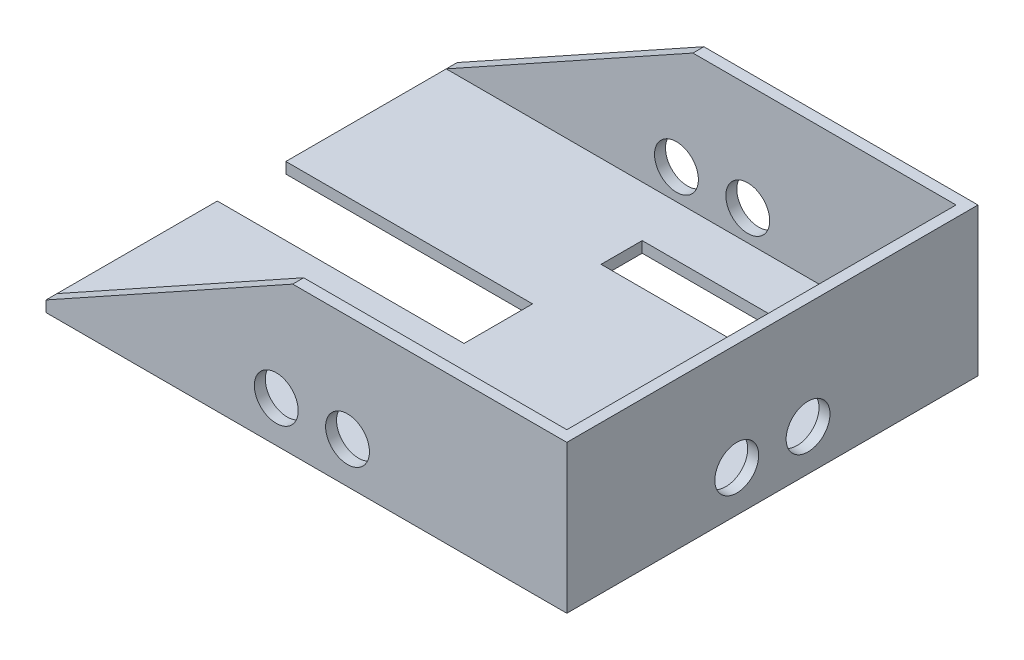
ISO-10303-21;
HEADER;
FILE_DESCRIPTION(('STEP AP214'),'2;1');
FILE_NAME('part.step','',(''),(''),'','','');
FILE_SCHEMA(('AUTOMOTIVE_DESIGN { 1 0 10303 214 1 1 1 1 }'));
ENDSEC;
DATA;
#1=APPLICATION_CONTEXT('core data for automotive mechanical design processes');
#2=APPLICATION_PROTOCOL_DEFINITION('international standard','automotive_design',2000,#1);
#3=PRODUCT_CONTEXT('',#1,'mechanical');
#4=PRODUCT('Part','Part','',(#3));
#5=PRODUCT_RELATED_PRODUCT_CATEGORY('part','',(#4));
#6=PRODUCT_DEFINITION_FORMATION('','',#4);
#7=PRODUCT_DEFINITION_CONTEXT('part definition',#1,'design');
#8=PRODUCT_DEFINITION('design','',#6,#7);
#9=PRODUCT_DEFINITION_SHAPE('','',#8);
#10=(LENGTH_UNIT() NAMED_UNIT(*) SI_UNIT(.MILLI.,.METRE.));
#11=(NAMED_UNIT(*) PLANE_ANGLE_UNIT() SI_UNIT($,.RADIAN.));
#12=(NAMED_UNIT(*) SI_UNIT($,.STERADIAN.) SOLID_ANGLE_UNIT());
#13=UNCERTAINTY_MEASURE_WITH_UNIT(LENGTH_MEASURE(1.E-05),#10,'distance_accuracy_value','');
#14=(GEOMETRIC_REPRESENTATION_CONTEXT(3) GLOBAL_UNCERTAINTY_ASSIGNED_CONTEXT((#13)) GLOBAL_UNIT_ASSIGNED_CONTEXT((#10,
#11,#12)) REPRESENTATION_CONTEXT('',''));
#15=CARTESIAN_POINT('',(0.,0.,0.));
#16=DIRECTION('',(0.,0.,1.));
#17=DIRECTION('',(1.,0.,0.));
#18=AXIS2_PLACEMENT_3D('',#15,#16,#17);
#19=CARTESIAN_POINT('',(0.,4.,0.));
#20=DIRECTION('',(0.,1.,0.));
#21=DIRECTION('',(0.,0.,1.));
#22=AXIS2_PLACEMENT_3D('',#19,#20,#21);
#23=PLANE('',#22);
#24=DIRECTION('',(0.,0.,1.));
#25=VECTOR('',#24,1.);
#26=CARTESIAN_POINT('',(75.,4.,-52.5));
#27=LINE('',#26,#25);
#28=CARTESIAN_POINT('',(75.,4.,-52.5));
#29=VERTEX_POINT('',#28);
#30=CARTESIAN_POINT('',(75.,4.,-37.5));
#31=VERTEX_POINT('',#30);
#32=EDGE_CURVE('E187',#29,#31,#27,.T.);
#33=ORIENTED_EDGE('',*,*,#32,.T.);
#34=DIRECTION('',(-1.,0.,0.));
#35=VECTOR('',#34,1.);
#36=CARTESIAN_POINT('',(75.,4.,-37.5));
#37=LINE('',#36,#35);
#38=CARTESIAN_POINT('',(-4.99999999999999,4.,-37.5));
#39=VERTEX_POINT('',#38);
#40=EDGE_CURVE('E198',#31,#39,#37,.T.);
#41=ORIENTED_EDGE('',*,*,#40,.T.);
#42=DIRECTION('',(0.,0.,1.));
#43=VECTOR('',#42,1.);
#44=CARTESIAN_POINT('',(-4.99999999999999,4.,-52.5));
#45=LINE('',#44,#43);
#46=CARTESIAN_POINT('',(-4.99999999999999,4.,-52.5));
#47=VERTEX_POINT('',#46);
#48=EDGE_CURVE('E196',#47,#39,#45,.T.);
#49=ORIENTED_EDGE('',*,*,#48,.F.);
#50=DIRECTION('',(-1.,0.,0.));
#51=VECTOR('',#50,1.);
#52=CARTESIAN_POINT('',(75.,4.,-52.5));
#53=LINE('',#52,#51);
#54=EDGE_CURVE('E179',#29,#47,#53,.T.);
#55=ORIENTED_EDGE('',*,*,#54,.F.);
#56=EDGE_LOOP('',(#33,#41,#49,#55));
#57=FACE_BOUND('',#56,.T.);
#58=DIRECTION('',(0.,0.,-1.));
#59=VECTOR('',#58,1.);
#60=CARTESIAN_POINT('',(91.,4.,-71.));
#61=LINE('',#60,#59);
#62=CARTESIAN_POINT('',(91.,4.,71.));
#63=VERTEX_POINT('',#62);
#64=CARTESIAN_POINT('',(91.,4.,-71.));
#65=VERTEX_POINT('',#64);
#66=EDGE_CURVE('E246',#63,#65,#61,.T.);
#67=ORIENTED_EDGE('',*,*,#66,.T.);
#68=DIRECTION('',(1.,0.,0.));
#69=VECTOR('',#68,1.);
#70=CARTESIAN_POINT('',(-95.,4.,-71.));
#71=LINE('',#70,#69);
#72=CARTESIAN_POINT('',(-95.,4.,-71.));
#73=VERTEX_POINT('',#72);
#74=EDGE_CURVE('E254',#73,#65,#71,.T.);
#75=ORIENTED_EDGE('',*,*,#74,.F.);
#76=DIRECTION('',(0.,0.,1.));
#77=VECTOR('',#76,1.);
#78=CARTESIAN_POINT('',(-95.,4.,-12.5));
#79=LINE('',#78,#77);
#80=CARTESIAN_POINT('',(-95.,4.,-12.5));
#81=VERTEX_POINT('',#80);
#82=EDGE_CURVE('E295',#73,#81,#79,.T.);
#83=ORIENTED_EDGE('',*,*,#82,.T.);
#84=DIRECTION('',(1.,0.,0.));
#85=VECTOR('',#84,1.);
#86=CARTESIAN_POINT('',(-4.99999999999997,4.,-12.5));
#87=LINE('',#86,#85);
#88=CARTESIAN_POINT('',(-4.99999999999997,4.,-12.5));
#89=VERTEX_POINT('',#88);
#90=EDGE_CURVE('E294',#81,#89,#87,.T.);
#91=ORIENTED_EDGE('',*,*,#90,.T.);
#92=DIRECTION('',(0.,0.,1.));
#93=VECTOR('',#92,1.);
#94=CARTESIAN_POINT('',(-4.99999999999996,4.,12.5));
#95=LINE('',#94,#93);
#96=CARTESIAN_POINT('',(-4.99999999999996,4.,12.5));
#97=VERTEX_POINT('',#96);
#98=EDGE_CURVE('E297',#89,#97,#95,.T.);
#99=ORIENTED_EDGE('',*,*,#98,.T.);
#100=DIRECTION('',(-1.,0.,0.));
#101=VECTOR('',#100,1.);
#102=CARTESIAN_POINT('',(-4.99999999999996,4.,12.5));
#103=LINE('',#102,#101);
#104=CARTESIAN_POINT('',(-95.,4.,12.5));
#105=VERTEX_POINT('',#104);
#106=EDGE_CURVE('E299',#97,#105,#103,.T.);
#107=ORIENTED_EDGE('',*,*,#106,.T.);
#108=DIRECTION('',(0.,0.,1.));
#109=VECTOR('',#108,1.);
#110=CARTESIAN_POINT('',(-95.,4.,75.));
#111=LINE('',#110,#109);
#112=CARTESIAN_POINT('',(-95.,4.,71.));
#113=VERTEX_POINT('',#112);
#114=EDGE_CURVE('E301',#105,#113,#111,.T.);
#115=ORIENTED_EDGE('',*,*,#114,.T.);
#116=DIRECTION('',(1.,0.,0.));
#117=VECTOR('',#116,1.);
#118=CARTESIAN_POINT('',(-95.,4.,71.));
#119=LINE('',#118,#117);
#120=EDGE_CURVE('E270',#113,#63,#119,.T.);
#121=ORIENTED_EDGE('',*,*,#120,.T.);
#122=EDGE_LOOP('',(#67,#75,#83,#91,#99,#107,#115,#121));
#123=FACE_BOUND('',#122,.T.);
#124=DIRECTION('',(-1.,0.,0.));
#125=VECTOR('',#124,1.);
#126=CARTESIAN_POINT('',(75.,4.,37.5));
#127=LINE('',#126,#125);
#128=CARTESIAN_POINT('',(75.,4.,37.5));
#129=VERTEX_POINT('',#128);
#130=CARTESIAN_POINT('',(-4.99999999999999,4.,37.5));
#131=VERTEX_POINT('',#130);
#132=EDGE_CURVE('E215',#129,#131,#127,.T.);
#133=ORIENTED_EDGE('',*,*,#132,.F.);
#134=DIRECTION('',(0.,0.,-1.));
#135=VECTOR('',#134,1.);
#136=CARTESIAN_POINT('',(75.,4.,52.5));
#137=LINE('',#136,#135);
#138=CARTESIAN_POINT('',(75.,4.,52.5));
#139=VERTEX_POINT('',#138);
#140=EDGE_CURVE('E213',#139,#129,#137,.T.);
#141=ORIENTED_EDGE('',*,*,#140,.F.);
#142=DIRECTION('',(-1.,0.,0.));
#143=VECTOR('',#142,1.);
#144=CARTESIAN_POINT('',(75.,4.,52.5));
#145=LINE('',#144,#143);
#146=CARTESIAN_POINT('',(-4.99999999999999,4.,52.5));
#147=VERTEX_POINT('',#146);
#148=EDGE_CURVE('E221',#139,#147,#145,.T.);
#149=ORIENTED_EDGE('',*,*,#148,.T.);
#150=DIRECTION('',(0.,0.,-1.));
#151=VECTOR('',#150,1.);
#152=CARTESIAN_POINT('',(-4.99999999999999,4.,52.5));
#153=LINE('',#152,#151);
#154=EDGE_CURVE('E218',#147,#131,#153,.T.);
#155=ORIENTED_EDGE('',*,*,#154,.T.);
#156=EDGE_LOOP('',(#133,#141,#149,#155));
#157=FACE_BOUND('',#156,.T.);
#158=ADVANCED_FACE('F32',(#57,#123,#157),#23,.T.);
#159=CARTESIAN_POINT('',(0.,0.,0.));
#160=DIRECTION('',(0.,1.,0.));
#161=DIRECTION('',(0.,0.,1.));
#162=AXIS2_PLACEMENT_3D('',#159,#160,#161);
#163=PLANE('',#162);
#164=DIRECTION('',(-1.,0.,0.));
#165=VECTOR('',#164,1.);
#166=CARTESIAN_POINT('',(75.,0.,-37.5));
#167=LINE('',#166,#165);
#168=CARTESIAN_POINT('',(75.,0.,-37.5));
#169=VERTEX_POINT('',#168);
#170=CARTESIAN_POINT('',(-4.99999999999999,0.,-37.5));
#171=VERTEX_POINT('',#170);
#172=EDGE_CURVE('E192',#169,#171,#167,.T.);
#173=ORIENTED_EDGE('',*,*,#172,.F.);
#174=DIRECTION('',(0.,0.,1.));
#175=VECTOR('',#174,1.);
#176=CARTESIAN_POINT('',(75.,0.,-52.5));
#177=LINE('',#176,#175);
#178=CARTESIAN_POINT('',(75.,0.,-52.5));
#179=VERTEX_POINT('',#178);
#180=EDGE_CURVE('E55',#179,#169,#177,.T.);
#181=ORIENTED_EDGE('',*,*,#180,.F.);
#182=DIRECTION('',(-1.,0.,0.));
#183=VECTOR('',#182,1.);
#184=CARTESIAN_POINT('',(75.,0.,-52.5));
#185=LINE('',#184,#183);
#186=CARTESIAN_POINT('',(-4.99999999999999,0.,-52.5));
#187=VERTEX_POINT('',#186);
#188=EDGE_CURVE('E182',#179,#187,#185,.T.);
#189=ORIENTED_EDGE('',*,*,#188,.T.);
#190=DIRECTION('',(0.,0.,1.));
#191=VECTOR('',#190,1.);
#192=CARTESIAN_POINT('',(-4.99999999999999,0.,-52.5));
#193=LINE('',#192,#191);
#194=EDGE_CURVE('E206',#187,#171,#193,.T.);
#195=ORIENTED_EDGE('',*,*,#194,.T.);
#196=EDGE_LOOP('',(#173,#181,#189,#195));
#197=FACE_BOUND('',#196,.T.);
#198=DIRECTION('',(0.,0.,1.));
#199=VECTOR('',#198,1.);
#200=CARTESIAN_POINT('',(-95.,0.,-12.5));
#201=LINE('',#200,#199);
#202=CARTESIAN_POINT('',(-95.,0.,-75.));
#203=VERTEX_POINT('',#202);
#204=CARTESIAN_POINT('',(-95.,0.,-12.5));
#205=VERTEX_POINT('',#204);
#206=EDGE_CURVE('E286',#203,#205,#201,.T.);
#207=ORIENTED_EDGE('',*,*,#206,.F.);
#208=DIRECTION('',(-1.,0.,0.));
#209=VECTOR('',#208,1.);
#210=CARTESIAN_POINT('',(95.,0.,-75.));
#211=LINE('',#210,#209);
#212=CARTESIAN_POINT('',(95.,0.,-75.));
#213=VERTEX_POINT('',#212);
#214=EDGE_CURVE('E319',#213,#203,#211,.T.);
#215=ORIENTED_EDGE('',*,*,#214,.F.);
#216=DIRECTION('',(0.,0.,-1.));
#217=VECTOR('',#216,1.);
#218=CARTESIAN_POINT('',(95.,0.,75.));
#219=LINE('',#218,#217);
#220=CARTESIAN_POINT('',(95.,0.,75.));
#221=VERTEX_POINT('',#220);
#222=EDGE_CURVE('E317',#221,#213,#219,.T.);
#223=ORIENTED_EDGE('',*,*,#222,.F.);
#224=DIRECTION('',(1.,0.,0.));
#225=VECTOR('',#224,1.);
#226=CARTESIAN_POINT('',(95.,0.,75.));
#227=LINE('',#226,#225);
#228=CARTESIAN_POINT('',(-95.,0.,75.));
#229=VERTEX_POINT('',#228);
#230=EDGE_CURVE('E315',#229,#221,#227,.T.);
#231=ORIENTED_EDGE('',*,*,#230,.F.);
#232=DIRECTION('',(0.,0.,1.));
#233=VECTOR('',#232,1.);
#234=CARTESIAN_POINT('',(-95.,0.,75.));
#235=LINE('',#234,#233);
#236=CARTESIAN_POINT('',(-95.,0.,12.5));
#237=VERTEX_POINT('',#236);
#238=EDGE_CURVE('E313',#237,#229,#235,.T.);
#239=ORIENTED_EDGE('',*,*,#238,.F.);
#240=DIRECTION('',(-1.,0.,0.));
#241=VECTOR('',#240,1.);
#242=CARTESIAN_POINT('',(-4.99999999999996,0.,12.5));
#243=LINE('',#242,#241);
#244=CARTESIAN_POINT('',(-4.99999999999996,0.,12.5));
#245=VERTEX_POINT('',#244);
#246=EDGE_CURVE('E311',#245,#237,#243,.T.);
#247=ORIENTED_EDGE('',*,*,#246,.F.);
#248=DIRECTION('',(0.,0.,1.));
#249=VECTOR('',#248,1.);
#250=CARTESIAN_POINT('',(-4.99999999999996,0.,12.5));
#251=LINE('',#250,#249);
#252=CARTESIAN_POINT('',(-4.99999999999997,0.,-12.5));
#253=VERTEX_POINT('',#252);
#254=EDGE_CURVE('E309',#253,#245,#251,.T.);
#255=ORIENTED_EDGE('',*,*,#254,.F.);
#256=DIRECTION('',(1.,0.,0.));
#257=VECTOR('',#256,1.);
#258=CARTESIAN_POINT('',(-4.99999999999997,0.,-12.5));
#259=LINE('',#258,#257);
#260=EDGE_CURVE('E307',#205,#253,#259,.T.);
#261=ORIENTED_EDGE('',*,*,#260,.F.);
#262=EDGE_LOOP('',(#207,#215,#223,#231,#239,#247,#255,#261));
#263=FACE_BOUND('',#262,.T.);
#264=DIRECTION('',(0.,0.,-1.));
#265=VECTOR('',#264,1.);
#266=CARTESIAN_POINT('',(75.,0.,52.5));
#267=LINE('',#266,#265);
#268=CARTESIAN_POINT('',(75.,0.,52.5));
#269=VERTEX_POINT('',#268);
#270=CARTESIAN_POINT('',(75.,0.,37.5));
#271=VERTEX_POINT('',#270);
#272=EDGE_CURVE('E183',#269,#271,#267,.T.);
#273=ORIENTED_EDGE('',*,*,#272,.T.);
#274=DIRECTION('',(-1.,0.,0.));
#275=VECTOR('',#274,1.);
#276=CARTESIAN_POINT('',(75.,0.,37.5));
#277=LINE('',#276,#275);
#278=CARTESIAN_POINT('',(-4.99999999999999,0.,37.5));
#279=VERTEX_POINT('',#278);
#280=EDGE_CURVE('E227',#271,#279,#277,.T.);
#281=ORIENTED_EDGE('',*,*,#280,.T.);
#282=DIRECTION('',(0.,0.,-1.));
#283=VECTOR('',#282,1.);
#284=CARTESIAN_POINT('',(-4.99999999999999,0.,52.5));
#285=LINE('',#284,#283);
#286=CARTESIAN_POINT('',(-4.99999999999999,0.,52.5));
#287=VERTEX_POINT('',#286);
#288=EDGE_CURVE('E230',#287,#279,#285,.T.);
#289=ORIENTED_EDGE('',*,*,#288,.F.);
#290=DIRECTION('',(-1.,0.,0.));
#291=VECTOR('',#290,1.);
#292=CARTESIAN_POINT('',(75.,0.,52.5));
#293=LINE('',#292,#291);
#294=EDGE_CURVE('E216',#269,#287,#293,.T.);
#295=ORIENTED_EDGE('',*,*,#294,.F.);
#296=EDGE_LOOP('',(#273,#281,#289,#295));
#297=FACE_BOUND('',#296,.T.);
#298=ADVANCED_FACE('F349',(#197,#263,#297),#163,.F.);
#299=CARTESIAN_POINT('',(-95.,4.,-12.5));
#300=DIRECTION('',(1.,0.,0.));
#301=DIRECTION('',(0.,0.,-1.));
#302=AXIS2_PLACEMENT_3D('',#299,#300,#301);
#303=PLANE('',#302);
#304=ORIENTED_EDGE('',*,*,#206,.T.);
#305=DIRECTION('',(0.,-1.,0.));
#306=VECTOR('',#305,1.);
#307=CARTESIAN_POINT('',(-95.,4.,-12.5));
#308=LINE('',#307,#306);
#309=EDGE_CURVE('E11',#81,#205,#308,.T.);
#310=ORIENTED_EDGE('',*,*,#309,.F.);
#311=ORIENTED_EDGE('',*,*,#82,.F.);
#312=CARTESIAN_POINT('',(-95.,4.,-75.));
#313=VERTEX_POINT('',#312);
#314=EDGE_CURVE('E291',#313,#73,#79,.T.);
#315=ORIENTED_EDGE('',*,*,#314,.F.);
#316=DIRECTION('',(0.,-1.,0.));
#317=VECTOR('',#316,1.);
#318=CARTESIAN_POINT('',(-95.,4.,-75.));
#319=LINE('',#318,#317);
#320=EDGE_CURVE('E304',#313,#203,#319,.T.);
#321=ORIENTED_EDGE('',*,*,#320,.T.);
#322=EDGE_LOOP('',(#304,#310,#311,#315,#321));
#323=FACE_BOUND('',#322,.T.);
#324=ADVANCED_FACE('F34',(#323),#303,.F.);
#325=CARTESIAN_POINT('',(-4.99999999999997,4.,-12.5));
#326=DIRECTION('',(0.,0.,-1.));
#327=DIRECTION('',(-1.,0.,0.));
#328=AXIS2_PLACEMENT_3D('',#325,#326,#327);
#329=PLANE('',#328);
#330=ORIENTED_EDGE('',*,*,#260,.T.);
#331=DIRECTION('',(0.,-1.,0.));
#332=VECTOR('',#331,1.);
#333=CARTESIAN_POINT('',(-4.99999999999997,4.,-12.5));
#334=LINE('',#333,#332);
#335=EDGE_CURVE('E40',#89,#253,#334,.T.);
#336=ORIENTED_EDGE('',*,*,#335,.F.);
#337=ORIENTED_EDGE('',*,*,#90,.F.);
#338=ORIENTED_EDGE('',*,*,#309,.T.);
#339=EDGE_LOOP('',(#330,#336,#337,#338));
#340=FACE_BOUND('',#339,.T.);
#341=ADVANCED_FACE('F366',(#340),#329,.F.);
#342=CARTESIAN_POINT('',(-4.99999999999996,4.,12.5));
#343=DIRECTION('',(1.,0.,0.));
#344=DIRECTION('',(0.,0.,-1.));
#345=AXIS2_PLACEMENT_3D('',#342,#343,#344);
#346=PLANE('',#345);
#347=ORIENTED_EDGE('',*,*,#254,.T.);
#348=DIRECTION('',(0.,-1.,0.));
#349=VECTOR('',#348,1.);
#350=CARTESIAN_POINT('',(-4.99999999999996,4.,12.5));
#351=LINE('',#350,#349);
#352=EDGE_CURVE('E335',#97,#245,#351,.T.);
#353=ORIENTED_EDGE('',*,*,#352,.F.);
#354=ORIENTED_EDGE('',*,*,#98,.F.);
#355=ORIENTED_EDGE('',*,*,#335,.T.);
#356=EDGE_LOOP('',(#347,#353,#354,#355));
#357=FACE_BOUND('',#356,.T.);
#358=ADVANCED_FACE('F342',(#357),#346,.F.);
#359=CARTESIAN_POINT('',(-4.99999999999996,4.,12.5));
#360=DIRECTION('',(0.,0.,1.));
#361=DIRECTION('',(1.,0.,0.));
#362=AXIS2_PLACEMENT_3D('',#359,#360,#361);
#363=PLANE('',#362);
#364=ORIENTED_EDGE('',*,*,#246,.T.);
#365=DIRECTION('',(0.,-1.,0.));
#366=VECTOR('',#365,1.);
#367=CARTESIAN_POINT('',(-95.,4.,12.5));
#368=LINE('',#367,#366);
#369=EDGE_CURVE('E332',#105,#237,#368,.T.);
#370=ORIENTED_EDGE('',*,*,#369,.F.);
#371=ORIENTED_EDGE('',*,*,#106,.F.);
#372=ORIENTED_EDGE('',*,*,#352,.T.);
#373=EDGE_LOOP('',(#364,#370,#371,#372));
#374=FACE_BOUND('',#373,.T.);
#375=ADVANCED_FACE('F355',(#374),#363,.F.);
#376=CARTESIAN_POINT('',(-95.,4.,75.));
#377=DIRECTION('',(1.,0.,0.));
#378=DIRECTION('',(0.,0.,-1.));
#379=AXIS2_PLACEMENT_3D('',#376,#377,#378);
#380=PLANE('',#379);
#381=ORIENTED_EDGE('',*,*,#238,.T.);
#382=DIRECTION('',(0.,-1.,0.));
#383=VECTOR('',#382,1.);
#384=CARTESIAN_POINT('',(-95.,4.,75.));
#385=LINE('',#384,#383);
#386=CARTESIAN_POINT('',(-95.,4.,75.));
#387=VERTEX_POINT('',#386);
#388=EDGE_CURVE('E329',#387,#229,#385,.T.);
#389=ORIENTED_EDGE('',*,*,#388,.F.);
#390=DIRECTION('',(0.,0.,1.));
#391=VECTOR('',#390,1.);
#392=CARTESIAN_POINT('',(-95.,4.,71.));
#393=LINE('',#392,#391);
#394=EDGE_CURVE('E284',#113,#387,#393,.T.);
#395=ORIENTED_EDGE('',*,*,#394,.F.);
#396=ORIENTED_EDGE('',*,*,#114,.F.);
#397=ORIENTED_EDGE('',*,*,#369,.T.);
#398=EDGE_LOOP('',(#381,#389,#395,#396,#397));
#399=FACE_BOUND('',#398,.T.);
#400=ADVANCED_FACE('F359',(#399),#380,.F.);
#401=CARTESIAN_POINT('',(95.,4.,75.));
#402=DIRECTION('',(0.,0.,-1.));
#403=DIRECTION('',(-1.,0.,0.));
#404=AXIS2_PLACEMENT_3D('',#401,#402,#403);
#405=PLANE('',#404);
#406=CARTESIAN_POINT('',(-11.,15.,75.));
#407=DIRECTION('',(0.,0.,-1.));
#408=DIRECTION('',(-1.,0.,0.));
#409=AXIS2_PLACEMENT_3D('',#406,#407,#408);
#410=CIRCLE('',#409,8.);
#411=CARTESIAN_POINT('',(-19.,15.,75.));
#412=VERTEX_POINT('',#411);
#413=EDGE_CURVE('E705',#412,#412,#410,.T.);
#414=ORIENTED_EDGE('',*,*,#413,.T.);
#415=EDGE_LOOP('',(#414));
#416=FACE_BOUND('',#415,.T.);
#417=CARTESIAN_POINT('',(15.,15.,75.));
#418=DIRECTION('',(0.,0.,-1.));
#419=DIRECTION('',(-1.,0.,0.));
#420=AXIS2_PLACEMENT_3D('',#417,#418,#419);
#421=CIRCLE('',#420,8.00000000000001);
#422=CARTESIAN_POINT('',(7.,15.,75.));
#423=VERTEX_POINT('',#422);
#424=EDGE_CURVE('E707',#423,#423,#421,.T.);
#425=ORIENTED_EDGE('',*,*,#424,.T.);
#426=EDGE_LOOP('',(#425));
#427=FACE_BOUND('',#426,.T.);
#428=ORIENTED_EDGE('',*,*,#230,.T.);
#429=DIRECTION('',(0.,-1.,0.));
#430=VECTOR('',#429,1.);
#431=CARTESIAN_POINT('',(95.,4.,75.));
#432=LINE('',#431,#430);
#433=CARTESIAN_POINT('',(95.,54.,75.));
#434=VERTEX_POINT('',#433);
#435=EDGE_CURVE('E326',#434,#221,#432,.T.);
#436=ORIENTED_EDGE('',*,*,#435,.F.);
#437=DIRECTION('',(-1.,0.,0.));
#438=VECTOR('',#437,1.);
#439=CARTESIAN_POINT('',(95.,54.,75.));
#440=LINE('',#439,#438);
#441=CARTESIAN_POINT('',(-4.99999999999999,54.,75.));
#442=VERTEX_POINT('',#441);
#443=EDGE_CURVE('E269',#434,#442,#440,.T.);
#444=ORIENTED_EDGE('',*,*,#443,.T.);
#445=DIRECTION('',(-0.874157276121538,-0.485642931178632,0.));
#446=VECTOR('',#445,1.);
#447=CARTESIAN_POINT('',(-4.99999999999999,54.,75.));
#448=LINE('',#447,#446);
#449=EDGE_CURVE('E274',#442,#387,#448,.T.);
#450=ORIENTED_EDGE('',*,*,#449,.T.);
#451=ORIENTED_EDGE('',*,*,#388,.T.);
#452=EDGE_LOOP('',(#428,#436,#444,#450,#451));
#453=FACE_BOUND('',#452,.T.);
#454=ADVANCED_FACE('F380',(#416,#427,#453),#405,.F.);
#455=CARTESIAN_POINT('',(95.,4.,75.));
#456=DIRECTION('',(-1.,0.,0.));
#457=DIRECTION('',(0.,0.,1.));
#458=AXIS2_PLACEMENT_3D('',#455,#456,#457);
#459=PLANE('',#458);
#460=CARTESIAN_POINT('',(95.,15.,-13.));
#461=DIRECTION('',(1.,0.,0.));
#462=DIRECTION('',(0.,0.,-1.));
#463=AXIS2_PLACEMENT_3D('',#460,#461,#462);
#464=CIRCLE('',#463,8.00000000000001);
#465=CARTESIAN_POINT('',(95.,15.,-21.));
#466=VERTEX_POINT('',#465);
#467=EDGE_CURVE('E725',#466,#466,#464,.T.);
#468=ORIENTED_EDGE('',*,*,#467,.F.);
#469=EDGE_LOOP('',(#468));
#470=FACE_BOUND('',#469,.T.);
#471=CARTESIAN_POINT('',(95.,15.,13.));
#472=DIRECTION('',(1.,0.,0.));
#473=DIRECTION('',(0.,0.,-1.));
#474=AXIS2_PLACEMENT_3D('',#471,#472,#473);
#475=CIRCLE('',#474,8.);
#476=CARTESIAN_POINT('',(95.,15.,5.));
#477=VERTEX_POINT('',#476);
#478=EDGE_CURVE('E731',#477,#477,#475,.T.);
#479=ORIENTED_EDGE('',*,*,#478,.F.);
#480=EDGE_LOOP('',(#479));
#481=FACE_BOUND('',#480,.T.);
#482=DIRECTION('',(0.,-1.,0.));
#483=VECTOR('',#482,1.);
#484=CARTESIAN_POINT('',(95.,4.,-75.));
#485=LINE('',#484,#483);
#486=CARTESIAN_POINT('',(95.,54.,-75.));
#487=VERTEX_POINT('',#486);
#488=EDGE_CURVE('E323',#487,#213,#485,.T.);
#489=ORIENTED_EDGE('',*,*,#488,.F.);
#490=DIRECTION('',(0.,0.,1.));
#491=VECTOR('',#490,1.);
#492=CARTESIAN_POINT('',(95.,54.,71.));
#493=LINE('',#492,#491);
#494=EDGE_CURVE('E279',#487,#434,#493,.T.);
#495=ORIENTED_EDGE('',*,*,#494,.T.);
#496=ORIENTED_EDGE('',*,*,#435,.T.);
#497=ORIENTED_EDGE('',*,*,#222,.T.);
#498=EDGE_LOOP('',(#489,#495,#496,#497));
#499=FACE_BOUND('',#498,.T.);
#500=ADVANCED_FACE('F377',(#470,#481,#499),#459,.F.);
#501=CARTESIAN_POINT('',(95.,4.,-75.));
#502=DIRECTION('',(0.,0.,1.));
#503=DIRECTION('',(1.,0.,0.));
#504=AXIS2_PLACEMENT_3D('',#501,#502,#503);
#505=PLANE('',#504);
#506=CARTESIAN_POINT('',(-11.,15.,-75.));
#507=DIRECTION('',(0.,0.,-1.));
#508=DIRECTION('',(-1.,0.,0.));
#509=AXIS2_PLACEMENT_3D('',#506,#507,#508);
#510=CIRCLE('',#509,8.);
#511=CARTESIAN_POINT('',(-19.,15.,-75.));
#512=VERTEX_POINT('',#511);
#513=EDGE_CURVE('E713',#512,#512,#510,.T.);
#514=ORIENTED_EDGE('',*,*,#513,.F.);
#515=EDGE_LOOP('',(#514));
#516=FACE_BOUND('',#515,.T.);
#517=CARTESIAN_POINT('',(15.,15.,-75.));
#518=DIRECTION('',(0.,0.,-1.));
#519=DIRECTION('',(-1.,0.,0.));
#520=AXIS2_PLACEMENT_3D('',#517,#518,#519);
#521=CIRCLE('',#520,8.00000000000001);
#522=CARTESIAN_POINT('',(7.,15.,-75.));
#523=VERTEX_POINT('',#522);
#524=EDGE_CURVE('E719',#523,#523,#521,.T.);
#525=ORIENTED_EDGE('',*,*,#524,.F.);
#526=EDGE_LOOP('',(#525));
#527=FACE_BOUND('',#526,.T.);
#528=ORIENTED_EDGE('',*,*,#214,.T.);
#529=ORIENTED_EDGE('',*,*,#320,.F.);
#530=DIRECTION('',(-0.874157276121538,-0.485642931178632,0.));
#531=VECTOR('',#530,1.);
#532=CARTESIAN_POINT('',(-4.99999999999999,54.,-75.));
#533=LINE('',#532,#531);
#534=CARTESIAN_POINT('',(-4.99999999999999,54.,-75.));
#535=VERTEX_POINT('',#534);
#536=EDGE_CURVE('E253',#535,#313,#533,.T.);
#537=ORIENTED_EDGE('',*,*,#536,.F.);
#538=DIRECTION('',(-1.,0.,0.));
#539=VECTOR('',#538,1.);
#540=CARTESIAN_POINT('',(95.,54.,-75.));
#541=LINE('',#540,#539);
#542=EDGE_CURVE('E258',#487,#535,#541,.T.);
#543=ORIENTED_EDGE('',*,*,#542,.F.);
#544=ORIENTED_EDGE('',*,*,#488,.T.);
#545=EDGE_LOOP('',(#528,#529,#537,#543,#544));
#546=FACE_BOUND('',#545,.T.);
#547=ADVANCED_FACE('F372',(#516,#527,#546),#505,.F.);
#548=CARTESIAN_POINT('',(-4.99999999999999,54.,71.));
#549=DIRECTION('',(-0.485642931178632,0.874157276121538,0.));
#550=DIRECTION('',(-0.874157276121538,-0.485642931178632,0.));
#551=AXIS2_PLACEMENT_3D('',#548,#549,#550);
#552=PLANE('',#551);
#553=ORIENTED_EDGE('',*,*,#449,.F.);
#554=DIRECTION('',(0.,0.,1.));
#555=VECTOR('',#554,1.);
#556=CARTESIAN_POINT('',(-4.99999999999999,54.,71.));
#557=LINE('',#556,#555);
#558=CARTESIAN_POINT('',(-4.99999999999999,54.,71.));
#559=VERTEX_POINT('',#558);
#560=EDGE_CURVE('E287',#559,#442,#557,.T.);
#561=ORIENTED_EDGE('',*,*,#560,.F.);
#562=DIRECTION('',(-0.874157276121538,-0.485642931178632,0.));
#563=VECTOR('',#562,1.);
#564=CARTESIAN_POINT('',(-4.99999999999999,54.,71.));
#565=LINE('',#564,#563);
#566=EDGE_CURVE('E276',#559,#113,#565,.T.);
#567=ORIENTED_EDGE('',*,*,#566,.T.);
#568=ORIENTED_EDGE('',*,*,#394,.T.);
#569=EDGE_LOOP('',(#553,#561,#567,#568));
#570=FACE_BOUND('',#569,.T.);
#571=ADVANCED_FACE('F384',(#570),#552,.T.);
#572=CARTESIAN_POINT('',(95.,54.,71.));
#573=DIRECTION('',(0.,1.,0.));
#574=DIRECTION('',(-1.,0.,0.));
#575=AXIS2_PLACEMENT_3D('',#572,#573,#574);
#576=PLANE('',#575);
#577=ORIENTED_EDGE('',*,*,#443,.F.);
#578=ORIENTED_EDGE('',*,*,#494,.F.);
#579=ORIENTED_EDGE('',*,*,#542,.T.);
#580=DIRECTION('',(0.,0.,-1.));
#581=VECTOR('',#580,1.);
#582=CARTESIAN_POINT('',(-4.99999999999999,54.,-71.));
#583=LINE('',#582,#581);
#584=CARTESIAN_POINT('',(-4.99999999999999,54.,-71.));
#585=VERTEX_POINT('',#584);
#586=EDGE_CURVE('E263',#585,#535,#583,.T.);
#587=ORIENTED_EDGE('',*,*,#586,.F.);
#588=DIRECTION('',(-1.,0.,0.));
#589=VECTOR('',#588,1.);
#590=CARTESIAN_POINT('',(95.,54.,-71.));
#591=LINE('',#590,#589);
#592=CARTESIAN_POINT('',(91.,54.,-71.));
#593=VERTEX_POINT('',#592);
#594=EDGE_CURVE('E261',#593,#585,#591,.T.);
#595=ORIENTED_EDGE('',*,*,#594,.F.);
#596=DIRECTION('',(0.,0.,1.));
#597=VECTOR('',#596,1.);
#598=CARTESIAN_POINT('',(91.,54.,71.));
#599=LINE('',#598,#597);
#600=CARTESIAN_POINT('',(91.,54.,71.));
#601=VERTEX_POINT('',#600);
#602=EDGE_CURVE('E250',#593,#601,#599,.T.);
#603=ORIENTED_EDGE('',*,*,#602,.T.);
#604=DIRECTION('',(-1.,0.,0.));
#605=VECTOR('',#604,1.);
#606=CARTESIAN_POINT('',(95.,54.,71.));
#607=LINE('',#606,#605);
#608=EDGE_CURVE('E273',#601,#559,#607,.T.);
#609=ORIENTED_EDGE('',*,*,#608,.T.);
#610=ORIENTED_EDGE('',*,*,#560,.T.);
#611=EDGE_LOOP('',(#577,#578,#579,#587,#595,#603,#609,#610));
#612=FACE_BOUND('',#611,.T.);
#613=ADVANCED_FACE('F395',(#612),#576,.T.);
#614=CARTESIAN_POINT('',(0.,0.,71.));
#615=DIRECTION('',(0.,0.,1.));
#616=DIRECTION('',(1.,0.,0.));
#617=AXIS2_PLACEMENT_3D('',#614,#615,#616);
#618=PLANE('',#617);
#619=CARTESIAN_POINT('',(-11.,15.,71.));
#620=DIRECTION('',(0.,0.,-1.));
#621=DIRECTION('',(-1.,0.,0.));
#622=AXIS2_PLACEMENT_3D('',#619,#620,#621);
#623=CIRCLE('',#622,8.);
#624=CARTESIAN_POINT('',(-19.,15.,71.));
#625=VERTEX_POINT('',#624);
#626=EDGE_CURVE('E702',#625,#625,#623,.T.);
#627=ORIENTED_EDGE('',*,*,#626,.F.);
#628=EDGE_LOOP('',(#627));
#629=FACE_BOUND('',#628,.T.);
#630=CARTESIAN_POINT('',(15.,15.,71.));
#631=DIRECTION('',(0.,0.,-1.));
#632=DIRECTION('',(-1.,0.,0.));
#633=AXIS2_PLACEMENT_3D('',#630,#631,#632);
#634=CIRCLE('',#633,8.00000000000001);
#635=CARTESIAN_POINT('',(7.,15.,71.));
#636=VERTEX_POINT('',#635);
#637=EDGE_CURVE('E710',#636,#636,#634,.T.);
#638=ORIENTED_EDGE('',*,*,#637,.F.);
#639=EDGE_LOOP('',(#638));
#640=FACE_BOUND('',#639,.T.);
#641=ORIENTED_EDGE('',*,*,#608,.F.);
#642=DIRECTION('',(0.,-1.,0.));
#643=VECTOR('',#642,1.);
#644=CARTESIAN_POINT('',(91.,4.,71.));
#645=LINE('',#644,#643);
#646=EDGE_CURVE('E244',#601,#63,#645,.T.);
#647=ORIENTED_EDGE('',*,*,#646,.T.);
#648=ORIENTED_EDGE('',*,*,#120,.F.);
#649=ORIENTED_EDGE('',*,*,#566,.F.);
#650=EDGE_LOOP('',(#641,#647,#648,#649));
#651=FACE_BOUND('',#650,.T.);
#652=ADVANCED_FACE('F387',(#629,#640,#651),#618,.F.);
#653=CARTESIAN_POINT('',(-4.99999999999999,54.,-71.));
#654=DIRECTION('',(0.485642931178632,-0.874157276121538,0.));
#655=DIRECTION('',(0.874157276121538,0.485642931178632,0.));
#656=AXIS2_PLACEMENT_3D('',#653,#654,#655);
#657=PLANE('',#656);
#658=ORIENTED_EDGE('',*,*,#536,.T.);
#659=ORIENTED_EDGE('',*,*,#314,.T.);
#660=DIRECTION('',(-0.874157276121538,-0.485642931178632,0.));
#661=VECTOR('',#660,1.);
#662=CARTESIAN_POINT('',(-4.99999999999999,54.,-71.));
#663=LINE('',#662,#661);
#664=EDGE_CURVE('E257',#585,#73,#663,.T.);
#665=ORIENTED_EDGE('',*,*,#664,.F.);
#666=ORIENTED_EDGE('',*,*,#586,.T.);
#667=EDGE_LOOP('',(#658,#659,#665,#666));
#668=FACE_BOUND('',#667,.T.);
#669=ADVANCED_FACE('F401',(#668),#657,.F.);
#670=CARTESIAN_POINT('',(0.,0.,-71.));
#671=DIRECTION('',(0.,0.,-1.));
#672=DIRECTION('',(1.,0.,0.));
#673=AXIS2_PLACEMENT_3D('',#670,#671,#672);
#674=PLANE('',#673);
#675=CARTESIAN_POINT('',(-11.,15.,-71.));
#676=DIRECTION('',(0.,0.,-1.));
#677=DIRECTION('',(-1.,0.,0.));
#678=AXIS2_PLACEMENT_3D('',#675,#676,#677);
#679=CIRCLE('',#678,8.);
#680=CARTESIAN_POINT('',(-19.,15.,-71.));
#681=VERTEX_POINT('',#680);
#682=EDGE_CURVE('E716',#681,#681,#679,.T.);
#683=ORIENTED_EDGE('',*,*,#682,.T.);
#684=EDGE_LOOP('',(#683));
#685=FACE_BOUND('',#684,.T.);
#686=CARTESIAN_POINT('',(15.,15.,-71.));
#687=DIRECTION('',(0.,0.,-1.));
#688=DIRECTION('',(-1.,0.,0.));
#689=AXIS2_PLACEMENT_3D('',#686,#687,#688);
#690=CIRCLE('',#689,8.00000000000001);
#691=CARTESIAN_POINT('',(7.,15.,-71.));
#692=VERTEX_POINT('',#691);
#693=EDGE_CURVE('E722',#692,#692,#690,.T.);
#694=ORIENTED_EDGE('',*,*,#693,.T.);
#695=EDGE_LOOP('',(#694));
#696=FACE_BOUND('',#695,.T.);
#697=ORIENTED_EDGE('',*,*,#74,.T.);
#698=DIRECTION('',(0.,1.,0.));
#699=VECTOR('',#698,1.);
#700=CARTESIAN_POINT('',(91.,54.,-71.));
#701=LINE('',#700,#699);
#702=EDGE_CURVE('E248',#65,#593,#701,.T.);
#703=ORIENTED_EDGE('',*,*,#702,.T.);
#704=ORIENTED_EDGE('',*,*,#594,.T.);
#705=ORIENTED_EDGE('',*,*,#664,.T.);
#706=EDGE_LOOP('',(#697,#703,#704,#705));
#707=FACE_BOUND('',#706,.T.);
#708=ADVANCED_FACE('F399',(#685,#696,#707),#674,.F.);
#709=CARTESIAN_POINT('',(91.,0.,0.));
#710=DIRECTION('',(-1.,0.,0.));
#711=DIRECTION('',(0.,0.,1.));
#712=AXIS2_PLACEMENT_3D('',#709,#710,#711);
#713=PLANE('',#712);
#714=CARTESIAN_POINT('',(91.,15.,-13.));
#715=DIRECTION('',(1.,0.,0.));
#716=DIRECTION('',(0.,0.,-1.));
#717=AXIS2_PLACEMENT_3D('',#714,#715,#716);
#718=CIRCLE('',#717,8.00000000000001);
#719=CARTESIAN_POINT('',(91.,15.,-21.));
#720=VERTEX_POINT('',#719);
#721=EDGE_CURVE('E728',#720,#720,#718,.T.);
#722=ORIENTED_EDGE('',*,*,#721,.T.);
#723=EDGE_LOOP('',(#722));
#724=FACE_BOUND('',#723,.T.);
#725=CARTESIAN_POINT('',(91.,15.,13.));
#726=DIRECTION('',(1.,0.,0.));
#727=DIRECTION('',(0.,0.,-1.));
#728=AXIS2_PLACEMENT_3D('',#725,#726,#727);
#729=CIRCLE('',#728,8.);
#730=CARTESIAN_POINT('',(91.,15.,5.));
#731=VERTEX_POINT('',#730);
#732=EDGE_CURVE('E204',#731,#731,#729,.T.);
#733=ORIENTED_EDGE('',*,*,#732,.T.);
#734=EDGE_LOOP('',(#733));
#735=FACE_BOUND('',#734,.T.);
#736=ORIENTED_EDGE('',*,*,#646,.F.);
#737=ORIENTED_EDGE('',*,*,#602,.F.);
#738=ORIENTED_EDGE('',*,*,#702,.F.);
#739=ORIENTED_EDGE('',*,*,#66,.F.);
#740=EDGE_LOOP('',(#736,#737,#738,#739));
#741=FACE_BOUND('',#740,.T.);
#742=ADVANCED_FACE('F391',(#724,#735,#741),#713,.T.);
#743=CARTESIAN_POINT('',(75.,4.,52.5));
#744=DIRECTION('',(-1.,0.,0.));
#745=DIRECTION('',(0.,0.,1.));
#746=AXIS2_PLACEMENT_3D('',#743,#744,#745);
#747=PLANE('',#746);
#748=ORIENTED_EDGE('',*,*,#272,.F.);
#749=DIRECTION('',(0.,-1.,0.));
#750=VECTOR('',#749,1.);
#751=CARTESIAN_POINT('',(75.,4.,52.5));
#752=LINE('',#751,#750);
#753=EDGE_CURVE('E224',#139,#269,#752,.T.);
#754=ORIENTED_EDGE('',*,*,#753,.F.);
#755=ORIENTED_EDGE('',*,*,#140,.T.);
#756=DIRECTION('',(0.,-1.,0.));
#757=VECTOR('',#756,1.);
#758=CARTESIAN_POINT('',(75.,4.,37.5));
#759=LINE('',#758,#757);
#760=EDGE_CURVE('E241',#129,#271,#759,.T.);
#761=ORIENTED_EDGE('',*,*,#760,.T.);
#762=EDGE_LOOP('',(#748,#754,#755,#761));
#763=FACE_BOUND('',#762,.T.);
#764=ADVANCED_FACE('F509',(#763),#747,.T.);
#765=CARTESIAN_POINT('',(75.,4.,37.5));
#766=DIRECTION('',(0.,0.,1.));
#767=DIRECTION('',(1.,0.,0.));
#768=AXIS2_PLACEMENT_3D('',#765,#766,#767);
#769=PLANE('',#768);
#770=ORIENTED_EDGE('',*,*,#280,.F.);
#771=ORIENTED_EDGE('',*,*,#760,.F.);
#772=ORIENTED_EDGE('',*,*,#132,.T.);
#773=DIRECTION('',(0.,-1.,0.));
#774=VECTOR('',#773,1.);
#775=CARTESIAN_POINT('',(-4.99999999999999,4.,37.5));
#776=LINE('',#775,#774);
#777=EDGE_CURVE('E239',#131,#279,#776,.T.);
#778=ORIENTED_EDGE('',*,*,#777,.T.);
#779=EDGE_LOOP('',(#770,#771,#772,#778));
#780=FACE_BOUND('',#779,.T.);
#781=ADVANCED_FACE('F611',(#780),#769,.T.);
#782=CARTESIAN_POINT('',(-4.99999999999999,4.,52.5));
#783=DIRECTION('',(-1.,0.,0.));
#784=DIRECTION('',(0.,0.,1.));
#785=AXIS2_PLACEMENT_3D('',#782,#783,#784);
#786=PLANE('',#785);
#787=ORIENTED_EDGE('',*,*,#288,.T.);
#788=ORIENTED_EDGE('',*,*,#777,.F.);
#789=ORIENTED_EDGE('',*,*,#154,.F.);
#790=DIRECTION('',(0.,-1.,0.));
#791=VECTOR('',#790,1.);
#792=CARTESIAN_POINT('',(-4.99999999999999,4.,52.5));
#793=LINE('',#792,#791);
#794=EDGE_CURVE('E237',#147,#287,#793,.T.);
#795=ORIENTED_EDGE('',*,*,#794,.T.);
#796=EDGE_LOOP('',(#787,#788,#789,#795));
#797=FACE_BOUND('',#796,.T.);
#798=ADVANCED_FACE('F607',(#797),#786,.F.);
#799=CARTESIAN_POINT('',(75.,4.,52.5));
#800=DIRECTION('',(0.,0.,1.));
#801=DIRECTION('',(1.,0.,0.));
#802=AXIS2_PLACEMENT_3D('',#799,#800,#801);
#803=PLANE('',#802);
#804=ORIENTED_EDGE('',*,*,#294,.T.);
#805=ORIENTED_EDGE('',*,*,#794,.F.);
#806=ORIENTED_EDGE('',*,*,#148,.F.);
#807=ORIENTED_EDGE('',*,*,#753,.T.);
#808=EDGE_LOOP('',(#804,#805,#806,#807));
#809=FACE_BOUND('',#808,.T.);
#810=ADVANCED_FACE('F460',(#809),#803,.F.);
#811=CARTESIAN_POINT('',(75.,4.,-52.5));
#812=DIRECTION('',(1.,0.,0.));
#813=DIRECTION('',(0.,0.,-1.));
#814=AXIS2_PLACEMENT_3D('',#811,#812,#813);
#815=PLANE('',#814);
#816=ORIENTED_EDGE('',*,*,#180,.T.);
#817=DIRECTION('',(0.,-1.,0.));
#818=VECTOR('',#817,1.);
#819=CARTESIAN_POINT('',(75.,4.,-37.5));
#820=LINE('',#819,#818);
#821=EDGE_CURVE('E189',#31,#169,#820,.T.);
#822=ORIENTED_EDGE('',*,*,#821,.F.);
#823=ORIENTED_EDGE('',*,*,#32,.F.);
#824=DIRECTION('',(0.,-1.,0.));
#825=VECTOR('',#824,1.);
#826=CARTESIAN_POINT('',(75.,4.,-52.5));
#827=LINE('',#826,#825);
#828=EDGE_CURVE('E175',#29,#179,#827,.T.);
#829=ORIENTED_EDGE('',*,*,#828,.T.);
#830=EDGE_LOOP('',(#816,#822,#823,#829));
#831=FACE_BOUND('',#830,.T.);
#832=ADVANCED_FACE('F188',(#831),#815,.F.);
#833=CARTESIAN_POINT('',(75.,4.,-52.5));
#834=DIRECTION('',(0.,0.,1.));
#835=DIRECTION('',(1.,0.,0.));
#836=AXIS2_PLACEMENT_3D('',#833,#834,#835);
#837=PLANE('',#836);
#838=ORIENTED_EDGE('',*,*,#188,.F.);
#839=ORIENTED_EDGE('',*,*,#828,.F.);
#840=ORIENTED_EDGE('',*,*,#54,.T.);
#841=DIRECTION('',(0.,-1.,0.));
#842=VECTOR('',#841,1.);
#843=CARTESIAN_POINT('',(-4.99999999999999,4.,-52.5));
#844=LINE('',#843,#842);
#845=EDGE_CURVE('E184',#47,#187,#844,.T.);
#846=ORIENTED_EDGE('',*,*,#845,.T.);
#847=EDGE_LOOP('',(#838,#839,#840,#846));
#848=FACE_BOUND('',#847,.T.);
#849=ADVANCED_FACE('F177',(#848),#837,.T.);
#850=CARTESIAN_POINT('',(-4.99999999999999,4.,-52.5));
#851=DIRECTION('',(1.,0.,0.));
#852=DIRECTION('',(0.,0.,-1.));
#853=AXIS2_PLACEMENT_3D('',#850,#851,#852);
#854=PLANE('',#853);
#855=ORIENTED_EDGE('',*,*,#194,.F.);
#856=ORIENTED_EDGE('',*,*,#845,.F.);
#857=ORIENTED_EDGE('',*,*,#48,.T.);
#858=DIRECTION('',(0.,-1.,0.));
#859=VECTOR('',#858,1.);
#860=CARTESIAN_POINT('',(-4.99999999999999,4.,-37.5));
#861=LINE('',#860,#859);
#862=EDGE_CURVE('E47',#39,#171,#861,.T.);
#863=ORIENTED_EDGE('',*,*,#862,.T.);
#864=EDGE_LOOP('',(#855,#856,#857,#863));
#865=FACE_BOUND('',#864,.T.);
#866=ADVANCED_FACE('F471',(#865),#854,.T.);
#867=CARTESIAN_POINT('',(75.,4.,-37.5));
#868=DIRECTION('',(0.,0.,1.));
#869=DIRECTION('',(1.,0.,0.));
#870=AXIS2_PLACEMENT_3D('',#867,#868,#869);
#871=PLANE('',#870);
#872=ORIENTED_EDGE('',*,*,#172,.T.);
#873=ORIENTED_EDGE('',*,*,#862,.F.);
#874=ORIENTED_EDGE('',*,*,#40,.F.);
#875=ORIENTED_EDGE('',*,*,#821,.T.);
#876=EDGE_LOOP('',(#872,#873,#874,#875));
#877=FACE_BOUND('',#876,.T.);
#878=ADVANCED_FACE('F480',(#877),#871,.F.);
#879=CARTESIAN_POINT('',(91.,15.,13.));
#880=DIRECTION('',(1.,0.,0.));
#881=DIRECTION('',(0.,0.,-1.));
#882=AXIS2_PLACEMENT_3D('',#879,#880,#881);
#883=CYLINDRICAL_SURFACE('',#882,8.);
#884=ORIENTED_EDGE('',*,*,#732,.F.);
#885=EDGE_LOOP('',(#884));
#886=FACE_BOUND('',#885,.T.);
#887=ORIENTED_EDGE('',*,*,#478,.T.);
#888=EDGE_LOOP('',(#887));
#889=FACE_BOUND('',#888,.T.);
#890=ADVANCED_FACE('F490',(#886,#889),#883,.F.);
#891=CARTESIAN_POINT('',(91.,15.,-13.));
#892=DIRECTION('',(1.,0.,0.));
#893=DIRECTION('',(0.,0.,-1.));
#894=AXIS2_PLACEMENT_3D('',#891,#892,#893);
#895=CYLINDRICAL_SURFACE('',#894,8.00000000000001);
#896=ORIENTED_EDGE('',*,*,#721,.F.);
#897=EDGE_LOOP('',(#896));
#898=FACE_BOUND('',#897,.T.);
#899=ORIENTED_EDGE('',*,*,#467,.T.);
#900=EDGE_LOOP('',(#899));
#901=FACE_BOUND('',#900,.T.);
#902=ADVANCED_FACE('F518',(#898,#901),#895,.F.);
#903=CARTESIAN_POINT('',(15.,15.,-71.));
#904=DIRECTION('',(0.,0.,-1.));
#905=DIRECTION('',(-1.,0.,0.));
#906=AXIS2_PLACEMENT_3D('',#903,#904,#905);
#907=CYLINDRICAL_SURFACE('',#906,8.00000000000001);
#908=ORIENTED_EDGE('',*,*,#693,.F.);
#909=EDGE_LOOP('',(#908));
#910=FACE_BOUND('',#909,.T.);
#911=ORIENTED_EDGE('',*,*,#524,.T.);
#912=EDGE_LOOP('',(#911));
#913=FACE_BOUND('',#912,.T.);
#914=ADVANCED_FACE('F528',(#910,#913),#907,.F.);
#915=CARTESIAN_POINT('',(-11.,15.,-71.));
#916=DIRECTION('',(0.,0.,-1.));
#917=DIRECTION('',(-1.,0.,0.));
#918=AXIS2_PLACEMENT_3D('',#915,#916,#917);
#919=CYLINDRICAL_SURFACE('',#918,8.);
#920=ORIENTED_EDGE('',*,*,#682,.F.);
#921=EDGE_LOOP('',(#920));
#922=FACE_BOUND('',#921,.T.);
#923=ORIENTED_EDGE('',*,*,#513,.T.);
#924=EDGE_LOOP('',(#923));
#925=FACE_BOUND('',#924,.T.);
#926=ADVANCED_FACE('F553',(#922,#925),#919,.F.);
#927=CARTESIAN_POINT('',(15.,15.,71.));
#928=DIRECTION('',(0.,0.,1.));
#929=DIRECTION('',(1.,0.,0.));
#930=AXIS2_PLACEMENT_3D('',#927,#928,#929);
#931=CYLINDRICAL_SURFACE('',#930,8.00000000000001);
#932=ORIENTED_EDGE('',*,*,#637,.T.);
#933=EDGE_LOOP('',(#932));
#934=FACE_BOUND('',#933,.T.);
#935=ORIENTED_EDGE('',*,*,#424,.F.);
#936=EDGE_LOOP('',(#935));
#937=FACE_BOUND('',#936,.T.);
#938=ADVANCED_FACE('F563',(#934,#937),#931,.F.);
#939=CARTESIAN_POINT('',(-11.,15.,71.));
#940=DIRECTION('',(0.,0.,1.));
#941=DIRECTION('',(1.,0.,0.));
#942=AXIS2_PLACEMENT_3D('',#939,#940,#941);
#943=CYLINDRICAL_SURFACE('',#942,8.);
#944=ORIENTED_EDGE('',*,*,#626,.T.);
#945=EDGE_LOOP('',(#944));
#946=FACE_BOUND('',#945,.T.);
#947=ORIENTED_EDGE('',*,*,#413,.F.);
#948=EDGE_LOOP('',(#947));
#949=FACE_BOUND('',#948,.T.);
#950=ADVANCED_FACE('F589',(#946,#949),#943,.F.);
#951=CLOSED_SHELL('',(#158,#298,#324,#341,#358,#375,#400,#454,#500,#547,#571,#613,#652,#669,
#708,#742,#764,#781,#798,#810,#832,#849,#866,#878,#890,#902,#914,#926,#938,#950));
#952=MANIFOLD_SOLID_BREP('B2',#951);
#953=ADVANCED_BREP_SHAPE_REPRESENTATION('',(#18,#952),#14);
#954=SHAPE_DEFINITION_REPRESENTATION(#9,#953);
ENDSEC;
END-ISO-10303-21;
